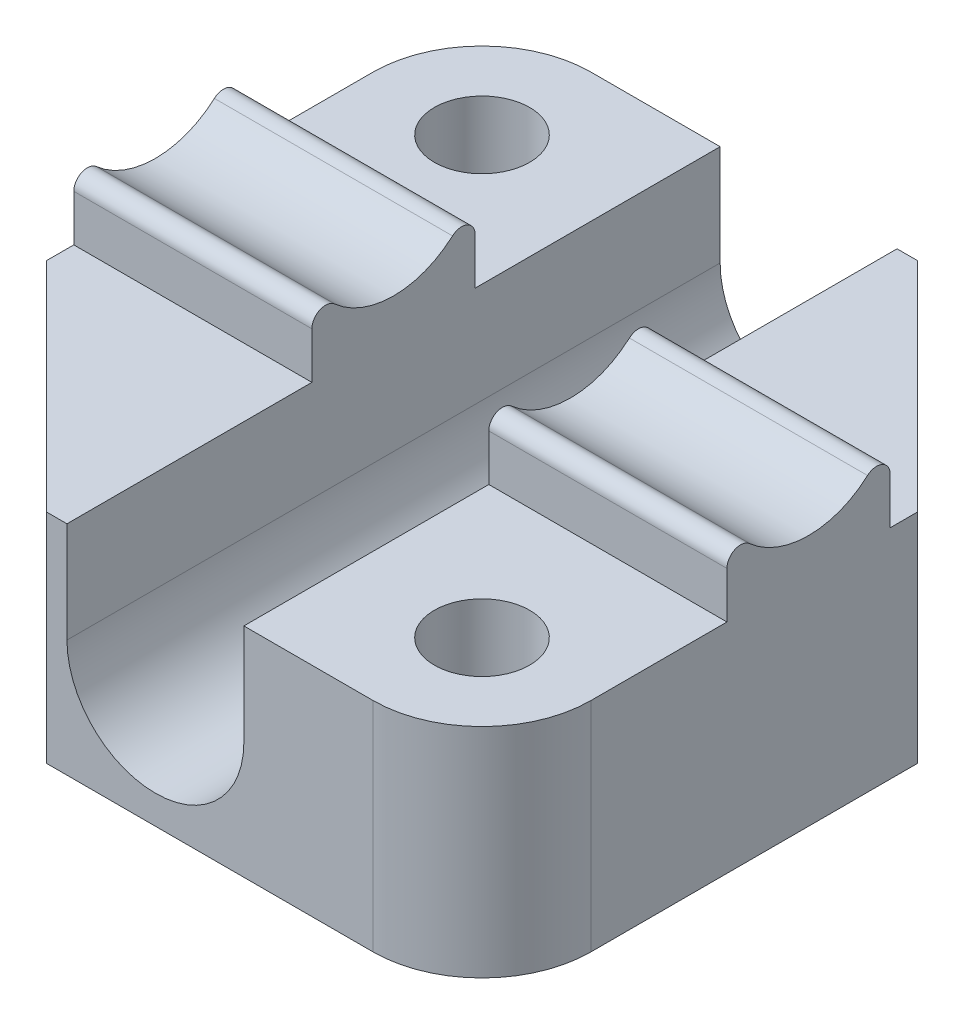
ISO-10303-21;
HEADER;
FILE_DESCRIPTION(('STEP AP214'),'2;1');
FILE_NAME('part.step','',(''),(''),'','','');
FILE_SCHEMA(('AUTOMOTIVE_DESIGN { 1 0 10303 214 1 1 1 1 }'));
ENDSEC;
DATA;
#1=APPLICATION_CONTEXT('core data for automotive mechanical design processes');
#2=APPLICATION_PROTOCOL_DEFINITION('international standard','automotive_design',2000,#1);
#3=PRODUCT_CONTEXT('',#1,'mechanical');
#4=PRODUCT('Part','Part','',(#3));
#5=PRODUCT_RELATED_PRODUCT_CATEGORY('part','',(#4));
#6=PRODUCT_DEFINITION_FORMATION('','',#4);
#7=PRODUCT_DEFINITION_CONTEXT('part definition',#1,'design');
#8=PRODUCT_DEFINITION('design','',#6,#7);
#9=PRODUCT_DEFINITION_SHAPE('','',#8);
#10=(LENGTH_UNIT() NAMED_UNIT(*) SI_UNIT(.MILLI.,.METRE.));
#11=(NAMED_UNIT(*) PLANE_ANGLE_UNIT() SI_UNIT($,.RADIAN.));
#12=(NAMED_UNIT(*) SI_UNIT($,.STERADIAN.) SOLID_ANGLE_UNIT());
#13=UNCERTAINTY_MEASURE_WITH_UNIT(LENGTH_MEASURE(1.E-05),#10,'distance_accuracy_value','');
#14=(GEOMETRIC_REPRESENTATION_CONTEXT(3) GLOBAL_UNCERTAINTY_ASSIGNED_CONTEXT((#13)) GLOBAL_UNIT_ASSIGNED_CONTEXT((#10,
#11,#12)) REPRESENTATION_CONTEXT('',''));
#15=CARTESIAN_POINT('',(0.,0.,0.));
#16=DIRECTION('',(0.,0.,1.));
#17=DIRECTION('',(1.,0.,0.));
#18=AXIS2_PLACEMENT_3D('',#15,#16,#17);
#19=CARTESIAN_POINT('',(0.,8.,0.));
#20=DIRECTION('',(0.,-1.,0.));
#21=DIRECTION('',(0.,0.,-1.));
#22=AXIS2_PLACEMENT_3D('',#19,#20,#21);
#23=PLANE('',#22);
#24=CARTESIAN_POINT('',(-8.,8.,-8.));
#25=DIRECTION('',(0.,1.,0.));
#26=DIRECTION('',(0.,0.,1.));
#27=AXIS2_PLACEMENT_3D('',#24,#25,#26);
#28=CIRCLE('',#27,1.75);
#29=CARTESIAN_POINT('',(-8.,8.,-6.25));
#30=VERTEX_POINT('',#29);
#31=EDGE_CURVE('E507',#30,#30,#28,.T.);
#32=ORIENTED_EDGE('',*,*,#31,.F.);
#33=EDGE_LOOP('',(#32));
#34=FACE_BOUND('',#33,.T.);
#35=DIRECTION('',(-1.,0.,0.));
#36=VECTOR('',#35,1.);
#37=CARTESIAN_POINT('',(-12.,8.,-12.));
#38=LINE('',#37,#36);
#39=CARTESIAN_POINT('',(-3.25,8.,-12.));
#40=VERTEX_POINT('',#39);
#41=CARTESIAN_POINT('',(-8.,8.,-12.));
#42=VERTEX_POINT('',#41);
#43=EDGE_CURVE('E241',#40,#42,#38,.T.);
#44=ORIENTED_EDGE('',*,*,#43,.T.);
#45=CARTESIAN_POINT('',(-8.,8.,-8.));
#46=DIRECTION('',(0.,-1.,0.));
#47=DIRECTION('',(0.,0.,-1.));
#48=AXIS2_PLACEMENT_3D('',#45,#46,#47);
#49=CIRCLE('',#48,4.);
#50=CARTESIAN_POINT('',(-12.,8.,-8.));
#51=VERTEX_POINT('',#50);
#52=EDGE_CURVE('E298',#42,#51,#49,.F.);
#53=ORIENTED_EDGE('',*,*,#52,.T.);
#54=DIRECTION('',(0.,0.,1.));
#55=VECTOR('',#54,1.);
#56=CARTESIAN_POINT('',(-12.,8.,12.));
#57=LINE('',#56,#55);
#58=CARTESIAN_POINT('',(-12.,8.,-3.));
#59=VERTEX_POINT('',#58);
#60=EDGE_CURVE('E211',#51,#59,#57,.T.);
#61=ORIENTED_EDGE('',*,*,#60,.T.);
#62=DIRECTION('',(-1.,0.,0.));
#63=VECTOR('',#62,1.);
#64=CARTESIAN_POINT('',(-3.25,8.,-3.));
#65=LINE('',#64,#63);
#66=CARTESIAN_POINT('',(-3.25,8.,-3.));
#67=VERTEX_POINT('',#66);
#68=EDGE_CURVE('E199',#67,#59,#65,.T.);
#69=ORIENTED_EDGE('',*,*,#68,.F.);
#70=DIRECTION('',(0.,0.,1.));
#71=VECTOR('',#70,1.);
#72=CARTESIAN_POINT('',(-3.25,8.,-12.));
#73=LINE('',#72,#71);
#74=EDGE_CURVE('E208',#40,#67,#73,.T.);
#75=ORIENTED_EDGE('',*,*,#74,.F.);
#76=EDGE_LOOP('',(#44,#53,#61,#69,#75));
#77=FACE_BOUND('',#76,.T.);
#78=ADVANCED_FACE('F35',(#34,#77),#23,.F.);
#79=CARTESIAN_POINT('',(8.,8.,8.));
#80=DIRECTION('',(0.,1.,0.));
#81=DIRECTION('',(0.,0.,-1.));
#82=AXIS2_PLACEMENT_3D('',#79,#80,#81);
#83=CIRCLE('',#82,1.75);
#84=CARTESIAN_POINT('',(8.,8.,6.25));
#85=VERTEX_POINT('',#84);
#86=EDGE_CURVE('E343',#85,#85,#83,.T.);
#87=ORIENTED_EDGE('',*,*,#86,.F.);
#88=EDGE_LOOP('',(#87));
#89=FACE_BOUND('',#88,.T.);
#90=DIRECTION('',(1.,0.,0.));
#91=VECTOR('',#90,1.);
#92=CARTESIAN_POINT('',(-12.,8.,12.));
#93=LINE('',#92,#91);
#94=CARTESIAN_POINT('',(3.25,8.,12.));
#95=VERTEX_POINT('',#94);
#96=CARTESIAN_POINT('',(8.,8.,12.));
#97=VERTEX_POINT('',#96);
#98=EDGE_CURVE('E247',#95,#97,#93,.T.);
#99=ORIENTED_EDGE('',*,*,#98,.T.);
#100=CARTESIAN_POINT('',(8.,8.,8.));
#101=DIRECTION('',(0.,-1.,0.));
#102=DIRECTION('',(0.,0.,-1.));
#103=AXIS2_PLACEMENT_3D('',#100,#101,#102);
#104=CIRCLE('',#103,4.);
#105=CARTESIAN_POINT('',(12.,8.,8.));
#106=VERTEX_POINT('',#105);
#107=EDGE_CURVE('E291',#97,#106,#104,.F.);
#108=ORIENTED_EDGE('',*,*,#107,.T.);
#109=DIRECTION('',(0.,0.,-1.));
#110=VECTOR('',#109,1.);
#111=CARTESIAN_POINT('',(12.,8.,12.));
#112=LINE('',#111,#110);
#113=CARTESIAN_POINT('',(12.,8.,3.));
#114=VERTEX_POINT('',#113);
#115=EDGE_CURVE('E239',#106,#114,#112,.T.);
#116=ORIENTED_EDGE('',*,*,#115,.T.);
#117=DIRECTION('',(1.,0.,0.));
#118=VECTOR('',#117,1.);
#119=CARTESIAN_POINT('',(3.25,8.,3.));
#120=LINE('',#119,#118);
#121=CARTESIAN_POINT('',(3.25,8.,3.));
#122=VERTEX_POINT('',#121);
#123=EDGE_CURVE('E462',#122,#114,#120,.T.);
#124=ORIENTED_EDGE('',*,*,#123,.F.);
#125=DIRECTION('',(0.,0.,1.));
#126=VECTOR('',#125,1.);
#127=CARTESIAN_POINT('',(3.25,8.,-12.));
#128=LINE('',#127,#126);
#129=EDGE_CURVE('E231',#122,#95,#128,.T.);
#130=ORIENTED_EDGE('',*,*,#129,.T.);
#131=EDGE_LOOP('',(#99,#108,#116,#124,#130));
#132=FACE_BOUND('',#131,.T.);
#133=ADVANCED_FACE('F395',(#89,#132),#23,.F.);
#134=CARTESIAN_POINT('',(-12.,8.,-12.));
#135=DIRECTION('',(0.,0.,1.));
#136=DIRECTION('',(1.,0.,0.));
#137=AXIS2_PLACEMENT_3D('',#134,#135,#136);
#138=PLANE('',#137);
#139=DIRECTION('',(-1.,0.,0.));
#140=VECTOR('',#139,1.);
#141=CARTESIAN_POINT('',(-12.,0.,-12.));
#142=LINE('',#141,#140);
#143=CARTESIAN_POINT('',(4.00000000000001,0.,-12.));
#144=VERTEX_POINT('',#143);
#145=CARTESIAN_POINT('',(-8.,0.,-12.));
#146=VERTEX_POINT('',#145);
#147=EDGE_CURVE('E252',#144,#146,#142,.T.);
#148=ORIENTED_EDGE('',*,*,#147,.T.);
#149=DIRECTION('',(0.,-1.,0.));
#150=VECTOR('',#149,1.);
#151=CARTESIAN_POINT('',(-8.,8.,-12.));
#152=LINE('',#151,#150);
#153=EDGE_CURVE('E296',#146,#42,#152,.F.);
#154=ORIENTED_EDGE('',*,*,#153,.T.);
#155=ORIENTED_EDGE('',*,*,#43,.F.);
#156=DIRECTION('',(0.,1.,0.));
#157=VECTOR('',#156,1.);
#158=CARTESIAN_POINT('',(-3.25,0.,-12.));
#159=LINE('',#158,#157);
#160=CARTESIAN_POINT('',(-3.25,4.3,-12.));
#161=VERTEX_POINT('',#160);
#162=EDGE_CURVE('E217',#161,#40,#159,.T.);
#163=ORIENTED_EDGE('',*,*,#162,.F.);
#164=CARTESIAN_POINT('',(0.,4.3,-12.));
#165=DIRECTION('',(0.,0.,1.));
#166=DIRECTION('',(1.,0.,0.));
#167=AXIS2_PLACEMENT_3D('',#164,#165,#166);
#168=CIRCLE('',#167,3.25);
#169=CARTESIAN_POINT('',(3.25,4.3,-12.));
#170=VERTEX_POINT('',#169);
#171=EDGE_CURVE('E469',#161,#170,#168,.T.);
#172=ORIENTED_EDGE('',*,*,#171,.T.);
#173=DIRECTION('',(0.,1.,0.));
#174=VECTOR('',#173,1.);
#175=CARTESIAN_POINT('',(3.25,0.,-12.));
#176=LINE('',#175,#174);
#177=CARTESIAN_POINT('',(3.25,8.,-12.));
#178=VERTEX_POINT('',#177);
#179=EDGE_CURVE('E228',#170,#178,#176,.T.);
#180=ORIENTED_EDGE('',*,*,#179,.T.);
#181=CARTESIAN_POINT('',(4.00000000000001,8.,-12.));
#182=VERTEX_POINT('',#181);
#183=EDGE_CURVE('E243',#182,#178,#38,.T.);
#184=ORIENTED_EDGE('',*,*,#183,.F.);
#185=DIRECTION('',(0.,-1.,0.));
#186=VECTOR('',#185,1.);
#187=CARTESIAN_POINT('',(4.00000000000001,8.,-12.));
#188=LINE('',#187,#186);
#189=EDGE_CURVE('E262',#182,#144,#188,.T.);
#190=ORIENTED_EDGE('',*,*,#189,.T.);
#191=EDGE_LOOP('',(#148,#154,#155,#163,#172,#180,#184,#190));
#192=FACE_BOUND('',#191,.T.);
#193=ADVANCED_FACE('F402',(#192),#138,.F.);
#194=CARTESIAN_POINT('',(-12.,8.,12.));
#195=DIRECTION('',(0.,0.,-1.));
#196=DIRECTION('',(-1.,0.,0.));
#197=AXIS2_PLACEMENT_3D('',#194,#195,#196);
#198=PLANE('',#197);
#199=DIRECTION('',(1.,0.,0.));
#200=VECTOR('',#199,1.);
#201=CARTESIAN_POINT('',(-12.,0.,12.));
#202=LINE('',#201,#200);
#203=CARTESIAN_POINT('',(-4.00000000000001,0.,12.));
#204=VERTEX_POINT('',#203);
#205=CARTESIAN_POINT('',(8.,0.,12.));
#206=VERTEX_POINT('',#205);
#207=EDGE_CURVE('E257',#204,#206,#202,.T.);
#208=ORIENTED_EDGE('',*,*,#207,.T.);
#209=DIRECTION('',(0.,-1.,0.));
#210=VECTOR('',#209,1.);
#211=CARTESIAN_POINT('',(8.,8.,12.));
#212=LINE('',#211,#210);
#213=EDGE_CURVE('E289',#206,#97,#212,.F.);
#214=ORIENTED_EDGE('',*,*,#213,.T.);
#215=ORIENTED_EDGE('',*,*,#98,.F.);
#216=DIRECTION('',(0.,-1.,0.));
#217=VECTOR('',#216,1.);
#218=CARTESIAN_POINT('',(3.25,8.,12.));
#219=LINE('',#218,#217);
#220=CARTESIAN_POINT('',(3.25,4.3,12.));
#221=VERTEX_POINT('',#220);
#222=EDGE_CURVE('E218',#95,#221,#219,.T.);
#223=ORIENTED_EDGE('',*,*,#222,.T.);
#224=CARTESIAN_POINT('',(0.,4.3,12.));
#225=DIRECTION('',(0.,0.,1.));
#226=DIRECTION('',(1.,0.,0.));
#227=AXIS2_PLACEMENT_3D('',#224,#225,#226);
#228=CIRCLE('',#227,3.25);
#229=CARTESIAN_POINT('',(-3.25,4.3,12.));
#230=VERTEX_POINT('',#229);
#231=EDGE_CURVE('E250',#221,#230,#228,.F.);
#232=ORIENTED_EDGE('',*,*,#231,.T.);
#233=DIRECTION('',(0.,-1.,0.));
#234=VECTOR('',#233,1.);
#235=CARTESIAN_POINT('',(-3.25,8.,12.));
#236=LINE('',#235,#234);
#237=CARTESIAN_POINT('',(-3.25,8.,12.));
#238=VERTEX_POINT('',#237);
#239=EDGE_CURVE('E222',#238,#230,#236,.T.);
#240=ORIENTED_EDGE('',*,*,#239,.F.);
#241=CARTESIAN_POINT('',(-4.00000000000001,8.,12.));
#242=VERTEX_POINT('',#241);
#243=EDGE_CURVE('E248',#242,#238,#93,.T.);
#244=ORIENTED_EDGE('',*,*,#243,.F.);
#245=DIRECTION('',(0.,-1.,0.));
#246=VECTOR('',#245,1.);
#247=CARTESIAN_POINT('',(-4.00000000000001,8.,12.));
#248=LINE('',#247,#246);
#249=EDGE_CURVE('E275',#242,#204,#248,.T.);
#250=ORIENTED_EDGE('',*,*,#249,.T.);
#251=EDGE_LOOP('',(#208,#214,#215,#223,#232,#240,#244,#250));
#252=FACE_BOUND('',#251,.T.);
#253=ADVANCED_FACE('F421',(#252),#198,.F.);
#254=CARTESIAN_POINT('',(-12.,8.,3.));
#255=VERTEX_POINT('',#254);
#256=CARTESIAN_POINT('',(-12.,8.,3.99999999999998));
#257=VERTEX_POINT('',#256);
#258=EDGE_CURVE('E245',#255,#257,#57,.T.);
#259=ORIENTED_EDGE('',*,*,#258,.T.);
#260=DIRECTION('',(-0.707106781186546,0.,-0.707106781186549));
#261=VECTOR('',#260,1.);
#262=CARTESIAN_POINT('',(-4.00000000000001,8.,12.));
#263=LINE('',#262,#261);
#264=EDGE_CURVE('E280',#257,#242,#263,.F.);
#265=ORIENTED_EDGE('',*,*,#264,.T.);
#266=ORIENTED_EDGE('',*,*,#243,.T.);
#267=CARTESIAN_POINT('',(-3.25,8.,3.));
#268=VERTEX_POINT('',#267);
#269=EDGE_CURVE('E219',#268,#238,#73,.T.);
#270=ORIENTED_EDGE('',*,*,#269,.F.);
#271=DIRECTION('',(-1.,0.,0.));
#272=VECTOR('',#271,1.);
#273=CARTESIAN_POINT('',(-3.25,8.,3.));
#274=LINE('',#273,#272);
#275=EDGE_CURVE('E202',#268,#255,#274,.T.);
#276=ORIENTED_EDGE('',*,*,#275,.T.);
#277=EDGE_LOOP('',(#259,#265,#266,#270,#276));
#278=FACE_BOUND('',#277,.T.);
#279=ADVANCED_FACE('F404',(#278),#23,.F.);
#280=CARTESIAN_POINT('',(12.,8.,12.));
#281=DIRECTION('',(-1.,0.,0.));
#282=DIRECTION('',(0.,0.,1.));
#283=AXIS2_PLACEMENT_3D('',#280,#281,#282);
#284=PLANE('',#283);
#285=DIRECTION('',(0.,1.,0.));
#286=VECTOR('',#285,1.);
#287=CARTESIAN_POINT('',(12.,8.,-3.));
#288=LINE('',#287,#286);
#289=CARTESIAN_POINT('',(12.,8.,-3.));
#290=VERTEX_POINT('',#289);
#291=CARTESIAN_POINT('',(12.,9.70491502812526,-3.));
#292=VERTEX_POINT('',#291);
#293=EDGE_CURVE('E213',#290,#292,#288,.T.);
#294=ORIENTED_EDGE('',*,*,#293,.T.);
#295=CARTESIAN_POINT('',(12.,9.70491502812526,-2.5));
#296=DIRECTION('',(-1.,0.,0.));
#297=DIRECTION('',(0.,0.,1.));
#298=AXIS2_PLACEMENT_3D('',#295,#296,#297);
#299=CIRCLE('',#298,0.5);
#300=CARTESIAN_POINT('',(12.,10.0775930243752,-2.16666666666667));
#301=VERTEX_POINT('',#300);
#302=EDGE_CURVE('E305',#292,#301,#299,.F.);
#303=ORIENTED_EDGE('',*,*,#302,.T.);
#304=CARTESIAN_POINT('',(12.,12.5,0.));
#305=DIRECTION('',(1.,0.,0.));
#306=DIRECTION('',(0.,0.,-1.));
#307=AXIS2_PLACEMENT_3D('',#304,#305,#306);
#308=CIRCLE('',#307,3.25);
#309=CARTESIAN_POINT('',(12.,10.0775930243752,2.16666666666667));
#310=VERTEX_POINT('',#309);
#311=EDGE_CURVE('E491',#310,#301,#308,.T.);
#312=ORIENTED_EDGE('',*,*,#311,.F.);
#313=CARTESIAN_POINT('',(12.,9.70491502812526,2.5));
#314=DIRECTION('',(-1.,0.,0.));
#315=DIRECTION('',(0.,0.,1.));
#316=AXIS2_PLACEMENT_3D('',#313,#314,#315);
#317=CIRCLE('',#316,0.5);
#318=CARTESIAN_POINT('',(12.,9.70491502812526,3.));
#319=VERTEX_POINT('',#318);
#320=EDGE_CURVE('E303',#310,#319,#317,.F.);
#321=ORIENTED_EDGE('',*,*,#320,.T.);
#322=DIRECTION('',(0.,1.,0.));
#323=VECTOR('',#322,1.);
#324=CARTESIAN_POINT('',(12.,8.,3.));
#325=LINE('',#324,#323);
#326=EDGE_CURVE('E457',#114,#319,#325,.T.);
#327=ORIENTED_EDGE('',*,*,#326,.F.);
#328=ORIENTED_EDGE('',*,*,#115,.F.);
#329=DIRECTION('',(0.,-1.,0.));
#330=VECTOR('',#329,1.);
#331=CARTESIAN_POINT('',(12.,8.,8.));
#332=LINE('',#331,#330);
#333=CARTESIAN_POINT('',(12.,0.,8.));
#334=VERTEX_POINT('',#333);
#335=EDGE_CURVE('E282',#106,#334,#332,.T.);
#336=ORIENTED_EDGE('',*,*,#335,.T.);
#337=DIRECTION('',(0.,0.,-1.));
#338=VECTOR('',#337,1.);
#339=CARTESIAN_POINT('',(12.,0.,12.));
#340=LINE('',#339,#338);
#341=CARTESIAN_POINT('',(12.,0.,-3.99999999999998));
#342=VERTEX_POINT('',#341);
#343=EDGE_CURVE('E238',#334,#342,#340,.T.);
#344=ORIENTED_EDGE('',*,*,#343,.T.);
#345=DIRECTION('',(0.,1.,0.));
#346=VECTOR('',#345,1.);
#347=CARTESIAN_POINT('',(12.,8.,-3.99999999999998));
#348=LINE('',#347,#346);
#349=CARTESIAN_POINT('',(12.,8.,-3.99999999999998));
#350=VERTEX_POINT('',#349);
#351=EDGE_CURVE('E271',#342,#350,#348,.T.);
#352=ORIENTED_EDGE('',*,*,#351,.T.);
#353=EDGE_CURVE('E242',#290,#350,#112,.T.);
#354=ORIENTED_EDGE('',*,*,#353,.F.);
#355=EDGE_LOOP('',(#294,#303,#312,#321,#327,#328,#336,#344,#352,#354));
#356=FACE_BOUND('',#355,.T.);
#357=ADVANCED_FACE('F416',(#356),#284,.F.);
#358=CARTESIAN_POINT('',(-12.,8.,12.));
#359=DIRECTION('',(1.,0.,0.));
#360=DIRECTION('',(0.,0.,-1.));
#361=AXIS2_PLACEMENT_3D('',#358,#359,#360);
#362=PLANE('',#361);
#363=CARTESIAN_POINT('',(-12.,12.5,0.));
#364=DIRECTION('',(1.,0.,0.));
#365=DIRECTION('',(0.,0.,-1.));
#366=AXIS2_PLACEMENT_3D('',#363,#364,#365);
#367=CIRCLE('',#366,3.25);
#368=CARTESIAN_POINT('',(-12.,10.0775930243752,2.16666666666667));
#369=VERTEX_POINT('',#368);
#370=CARTESIAN_POINT('',(-12.,10.0775930243752,-2.16666666666667));
#371=VERTEX_POINT('',#370);
#372=EDGE_CURVE('E503',#369,#371,#367,.T.);
#373=ORIENTED_EDGE('',*,*,#372,.T.);
#374=CARTESIAN_POINT('',(-12.,9.70491502812526,-2.5));
#375=DIRECTION('',(1.,0.,0.));
#376=DIRECTION('',(0.,0.,-1.));
#377=AXIS2_PLACEMENT_3D('',#374,#375,#376);
#378=CIRCLE('',#377,0.5);
#379=CARTESIAN_POINT('',(-12.,9.70491502812526,-3.));
#380=VERTEX_POINT('',#379);
#381=EDGE_CURVE('E323',#371,#380,#378,.F.);
#382=ORIENTED_EDGE('',*,*,#381,.T.);
#383=DIRECTION('',(0.,1.,0.));
#384=VECTOR('',#383,1.);
#385=CARTESIAN_POINT('',(-12.,8.,-3.));
#386=LINE('',#385,#384);
#387=EDGE_CURVE('E500',#59,#380,#386,.T.);
#388=ORIENTED_EDGE('',*,*,#387,.F.);
#389=ORIENTED_EDGE('',*,*,#60,.F.);
#390=DIRECTION('',(0.,-1.,0.));
#391=VECTOR('',#390,1.);
#392=CARTESIAN_POINT('',(-12.,8.,-8.));
#393=LINE('',#392,#391);
#394=CARTESIAN_POINT('',(-12.,0.,-8.));
#395=VERTEX_POINT('',#394);
#396=EDGE_CURVE('E293',#51,#395,#393,.T.);
#397=ORIENTED_EDGE('',*,*,#396,.T.);
#398=DIRECTION('',(0.,0.,1.));
#399=VECTOR('',#398,1.);
#400=CARTESIAN_POINT('',(-12.,0.,12.));
#401=LINE('',#400,#399);
#402=CARTESIAN_POINT('',(-12.,0.,3.99999999999998));
#403=VERTEX_POINT('',#402);
#404=EDGE_CURVE('E255',#395,#403,#401,.T.);
#405=ORIENTED_EDGE('',*,*,#404,.T.);
#406=DIRECTION('',(0.,1.,0.));
#407=VECTOR('',#406,1.);
#408=CARTESIAN_POINT('',(-12.,8.,3.99999999999998));
#409=LINE('',#408,#407);
#410=EDGE_CURVE('E278',#403,#257,#409,.T.);
#411=ORIENTED_EDGE('',*,*,#410,.T.);
#412=ORIENTED_EDGE('',*,*,#258,.F.);
#413=DIRECTION('',(0.,1.,0.));
#414=VECTOR('',#413,1.);
#415=CARTESIAN_POINT('',(-12.,8.,3.));
#416=LINE('',#415,#414);
#417=CARTESIAN_POINT('',(-12.,9.70491502812526,3.));
#418=VERTEX_POINT('',#417);
#419=EDGE_CURVE('E506',#255,#418,#416,.T.);
#420=ORIENTED_EDGE('',*,*,#419,.T.);
#421=CARTESIAN_POINT('',(-12.,9.70491502812526,2.5));
#422=DIRECTION('',(1.,0.,0.));
#423=DIRECTION('',(0.,0.,-1.));
#424=AXIS2_PLACEMENT_3D('',#421,#422,#423);
#425=CIRCLE('',#424,0.5);
#426=EDGE_CURVE('E321',#418,#369,#425,.F.);
#427=ORIENTED_EDGE('',*,*,#426,.T.);
#428=EDGE_LOOP('',(#373,#382,#388,#389,#397,#405,#411,#412,#420,#427));
#429=FACE_BOUND('',#428,.T.);
#430=ADVANCED_FACE('F409',(#429),#362,.F.);
#431=ORIENTED_EDGE('',*,*,#353,.T.);
#432=DIRECTION('',(0.707106781186546,0.,0.707106781186549));
#433=VECTOR('',#432,1.);
#434=CARTESIAN_POINT('',(4.00000000000001,8.,-12.));
#435=LINE('',#434,#433);
#436=EDGE_CURVE('E273',#350,#182,#435,.F.);
#437=ORIENTED_EDGE('',*,*,#436,.T.);
#438=ORIENTED_EDGE('',*,*,#183,.T.);
#439=CARTESIAN_POINT('',(3.25,8.,-3.));
#440=VERTEX_POINT('',#439);
#441=EDGE_CURVE('E225',#178,#440,#128,.T.);
#442=ORIENTED_EDGE('',*,*,#441,.T.);
#443=DIRECTION('',(1.,0.,0.));
#444=VECTOR('',#443,1.);
#445=CARTESIAN_POINT('',(3.25,8.,-3.));
#446=LINE('',#445,#444);
#447=EDGE_CURVE('E467',#440,#290,#446,.T.);
#448=ORIENTED_EDGE('',*,*,#447,.T.);
#449=EDGE_LOOP('',(#431,#437,#438,#442,#448));
#450=FACE_BOUND('',#449,.T.);
#451=ADVANCED_FACE('F398',(#450),#23,.F.);
#452=CARTESIAN_POINT('',(0.,0.,0.));
#453=DIRECTION('',(0.,-1.,0.));
#454=DIRECTION('',(0.,0.,-1.));
#455=AXIS2_PLACEMENT_3D('',#452,#453,#454);
#456=PLANE('',#455);
#457=CARTESIAN_POINT('',(8.,0.,8.));
#458=DIRECTION('',(0.,-1.,0.));
#459=DIRECTION('',(0.,0.,-1.));
#460=AXIS2_PLACEMENT_3D('',#457,#458,#459);
#461=CIRCLE('',#460,2.25000000000001);
#462=CARTESIAN_POINT('',(8.,0.,5.74999999999999));
#463=VERTEX_POINT('',#462);
#464=EDGE_CURVE('E564',#463,#463,#461,.F.);
#465=ORIENTED_EDGE('',*,*,#464,.T.);
#466=EDGE_LOOP('',(#465));
#467=FACE_BOUND('',#466,.T.);
#468=CARTESIAN_POINT('',(-8.,0.,-8.));
#469=DIRECTION('',(0.,-1.,0.));
#470=DIRECTION('',(0.,0.,-1.));
#471=AXIS2_PLACEMENT_3D('',#468,#469,#470);
#472=CIRCLE('',#471,2.25000000000001);
#473=CARTESIAN_POINT('',(-8.,0.,-10.25));
#474=VERTEX_POINT('',#473);
#475=EDGE_CURVE('E334',#474,#474,#472,.F.);
#476=ORIENTED_EDGE('',*,*,#475,.T.);
#477=EDGE_LOOP('',(#476));
#478=FACE_BOUND('',#477,.T.);
#479=CARTESIAN_POINT('',(0.,0.,0.));
#480=DIRECTION('',(0.,-1.,0.));
#481=DIRECTION('',(0.,0.,-1.));
#482=AXIS2_PLACEMENT_3D('',#479,#480,#481);
#483=CIRCLE('',#482,2.);
#484=CARTESIAN_POINT('',(0.,0.,-2.));
#485=VERTEX_POINT('',#484);
#486=EDGE_CURVE('E344',#485,#485,#483,.T.);
#487=ORIENTED_EDGE('',*,*,#486,.F.);
#488=EDGE_LOOP('',(#487));
#489=FACE_BOUND('',#488,.T.);
#490=ORIENTED_EDGE('',*,*,#343,.F.);
#491=CARTESIAN_POINT('',(8.,0.,8.));
#492=DIRECTION('',(0.,-1.,0.));
#493=DIRECTION('',(0.,0.,-1.));
#494=AXIS2_PLACEMENT_3D('',#491,#492,#493);
#495=CIRCLE('',#494,4.);
#496=EDGE_CURVE('E287',#334,#206,#495,.T.);
#497=ORIENTED_EDGE('',*,*,#496,.T.);
#498=ORIENTED_EDGE('',*,*,#207,.F.);
#499=DIRECTION('',(0.707106781186546,0.,0.707106781186549));
#500=VECTOR('',#499,1.);
#501=CARTESIAN_POINT('',(-8.00000000000001,0.,7.99999999999998));
#502=LINE('',#501,#500);
#503=EDGE_CURVE('E265',#204,#403,#502,.F.);
#504=ORIENTED_EDGE('',*,*,#503,.T.);
#505=ORIENTED_EDGE('',*,*,#404,.F.);
#506=CARTESIAN_POINT('',(-8.,0.,-8.));
#507=DIRECTION('',(0.,-1.,0.));
#508=DIRECTION('',(0.,0.,-1.));
#509=AXIS2_PLACEMENT_3D('',#506,#507,#508);
#510=CIRCLE('',#509,4.);
#511=EDGE_CURVE('E285',#395,#146,#510,.T.);
#512=ORIENTED_EDGE('',*,*,#511,.T.);
#513=ORIENTED_EDGE('',*,*,#147,.F.);
#514=DIRECTION('',(-0.707106781186546,0.,-0.707106781186549));
#515=VECTOR('',#514,1.);
#516=CARTESIAN_POINT('',(8.00000000000001,0.,-7.99999999999998));
#517=LINE('',#516,#515);
#518=EDGE_CURVE('E268',#144,#342,#517,.F.);
#519=ORIENTED_EDGE('',*,*,#518,.T.);
#520=EDGE_LOOP('',(#490,#497,#498,#504,#505,#512,#513,#519));
#521=FACE_BOUND('',#520,.T.);
#522=ADVANCED_FACE('F408',(#467,#478,#489,#521),#456,.T.);
#523=CARTESIAN_POINT('',(0.,4.3,-12.));
#524=DIRECTION('',(0.,0.,1.));
#525=DIRECTION('',(1.,0.,0.));
#526=AXIS2_PLACEMENT_3D('',#523,#524,#525);
#527=CYLINDRICAL_SURFACE('',#526,3.25);
#528=CARTESIAN_POINT('',(0.,1.05,-2.));
#529=CARTESIAN_POINT('',(0.10188132615055,1.05000709042641,-1.99999223881238));
#530=CARTESIAN_POINT('',(0.203904103349815,1.05484207993841,-1.99216106424513));
#531=CARTESIAN_POINT('',(0.404842186070283,1.07372622710523,-1.96124608973787));
#532=CARTESIAN_POINT('',(0.503750411471347,1.08779498468937,-1.93812984437488));
#533=CARTESIAN_POINT('',(0.69514473213188,1.12372705529894,-1.87797427817155));
#534=CARTESIAN_POINT('',(0.787660008863522,1.14555170941448,-1.84100396338244));
#535=CARTESIAN_POINT('',(0.964865128941514,1.19516273730987,-1.75464001753296));
#536=CARTESIAN_POINT('',(1.04955624068904,1.22294814233793,-1.70524840497948));
#537=CARTESIAN_POINT('',(1.21623879138585,1.28474377980787,-1.59114837284488));
#538=CARTESIAN_POINT('',(1.2974950249712,1.31907160252721,-1.52554128938594));
#539=CARTESIAN_POINT('',(1.44856625896382,1.38948142143222,-1.38292006727544));
#540=CARTESIAN_POINT('',(1.51836589377143,1.42556569066295,-1.30589086845065));
#541=CARTESIAN_POINT('',(1.6537974950807,1.50103440147234,-1.13082108971031));
#542=CARTESIAN_POINT('',(1.71769808834148,1.54023532279291,-1.0313504004329));
#543=CARTESIAN_POINT('',(1.82766613597321,1.6117932701056,-0.820781529591239));
#544=CARTESIAN_POINT('',(1.87376330939879,1.64416166024131,-0.709703122045502));
#545=CARTESIAN_POINT('',(1.93663007531596,1.68981298800098,-0.507603992249496));
#546=CARTESIAN_POINT('',(1.95786551874072,1.70585114290655,-0.418598382650922));
#547=CARTESIAN_POINT('',(1.98797289662736,1.72884546195975,-0.237419347642413));
#548=CARTESIAN_POINT('',(1.99686146422318,1.73581384368248,-0.145250355762082));
#549=CARTESIAN_POINT('',(2.00175000655706,1.73962702201248,0.0398636884012098));
#550=CARTESIAN_POINT('',(1.99771967393425,1.73644801321249,0.13281005462901));
#551=CARTESIAN_POINT('',(1.97697133638861,1.72041759661331,0.316446433338687));
#552=CARTESIAN_POINT('',(1.96024338773127,1.70755860831114,0.407134619884074));
#553=CARTESIAN_POINT('',(1.91546110388895,1.67430805717643,0.582267812593107));
#554=CARTESIAN_POINT('',(1.88762552544911,1.65406259017612,0.666798115990082));
#555=CARTESIAN_POINT('',(1.82169352273914,1.60824575420991,0.830182914664653));
#556=CARTESIAN_POINT('',(1.78359342306537,1.58267247826749,0.909035364038927));
#557=CARTESIAN_POINT('',(1.69022183410356,1.52345000053112,1.07410837738161));
#558=CARTESIAN_POINT('',(1.63308612098802,1.48917846864654,1.15905115829329));
#559=CARTESIAN_POINT('',(1.50681538592695,1.41951073688712,1.31905669865881));
#560=CARTESIAN_POINT('',(1.43766832976988,1.38411343843887,1.39410941531334));
#561=CARTESIAN_POINT('',(1.2766674389618,1.30974227547488,1.54402409710659));
#562=CARTESIAN_POINT('',(1.182955630921,1.2710626325799,1.61705916240018));
#563=CARTESIAN_POINT('',(0.982297748331433,1.20017910581058,1.74622462373111));
#564=CARTESIAN_POINT('',(0.875357722797127,1.16797227959435,1.80236270641464));
#565=CARTESIAN_POINT('',(0.657333180235023,1.11531144103009,1.89235101894978));
#566=CARTESIAN_POINT('',(0.546848787692421,1.09428411033942,1.92730509359417));
#567=CARTESIAN_POINT('',(0.320015702193349,1.06377937076516,1.97763358395682));
#568=CARTESIAN_POINT('',(0.203675020090538,1.05428660800891,1.99303402909634));
#569=CARTESIAN_POINT('',(-0.0133751121969597,1.04847888539736,2.00247098840239));
#570=CARTESIAN_POINT('',(-0.113930519426018,1.05046755966392,1.99925743978143));
#571=CARTESIAN_POINT('',(-0.312828128438587,1.06355702735641,1.97791203828788));
#572=CARTESIAN_POINT('',(-0.411170435426588,1.07465738669467,1.95978089610082));
#573=CARTESIAN_POINT('',(-0.599675310389413,1.1044236757768,1.91038715524057));
#574=CARTESIAN_POINT('',(-0.690000941068836,1.12282673371163,1.87957957275139));
#575=CARTESIAN_POINT('',(-0.864136822693357,1.16570308772745,1.8061572347355));
#576=CARTESIAN_POINT('',(-0.947945911471298,1.1901774633274,1.76354037928695));
#577=CARTESIAN_POINT('',(-1.11596559810314,1.24619182838784,1.66288062931433));
#578=CARTESIAN_POINT('',(-1.19933976552702,1.27819855010881,1.60370548122827));
#579=CARTESIAN_POINT('',(-1.35558080044099,1.34498114667612,1.47401785508296));
#580=CARTESIAN_POINT('',(-1.42843552095417,1.37976015195795,1.40349246622746));
#581=CARTESIAN_POINT('',(-1.57209410371064,1.45422469001532,1.24169624638608));
#582=CARTESIAN_POINT('',(-1.64118984864469,1.49391696319292,1.14890366751528));
#583=CARTESIAN_POINT('',(-1.76298838595567,1.56879394048457,0.951470248786335));
#584=CARTESIAN_POINT('',(-1.81570499765242,1.60398242968501,0.846839499217129));
#585=CARTESIAN_POINT('',(-1.89339358839071,1.6581613311761,0.650899733779575));
#586=CARTESIAN_POINT('',(-1.92188436296886,1.67900566963833,0.561505445797855));
#587=CARTESIAN_POINT('',(-1.96618336594087,1.71206648537687,0.378137789528581));
#588=CARTESIAN_POINT('',(-1.98201065217434,1.72429592426451,0.284171528762354));
#589=CARTESIAN_POINT('',(-2.00010464267678,1.7383158380037,0.0936616473844894));
#590=CARTESIAN_POINT('',(-2.0023046831458,1.74005499383558,-0.00289232645302492));
#591=CARTESIAN_POINT('',(-1.99280157568836,1.732652740724,-0.194910569759687));
#592=CARTESIAN_POINT('',(-1.98109240693129,1.72350661990577,-0.290374349255553));
#593=CARTESIAN_POINT('',(-1.94579545599171,1.69676782440383,-0.470934027473978));
#594=CARTESIAN_POINT('',(-1.92306270422408,1.67978687356565,-0.556294824863431));
#595=CARTESIAN_POINT('',(-1.86718802785544,1.63968290695689,-0.721985032960768));
#596=CARTESIAN_POINT('',(-1.83404200040863,1.61655747080508,-0.802312445519045));
#597=CARTESIAN_POINT('',(-1.75262914114964,1.56257232880558,-0.968550615604479));
#598=CARTESIAN_POINT('',(-1.70284443802986,1.53107350495229,-1.05350732582916));
#599=CARTESIAN_POINT('',(-1.59188565276047,1.46582435029827,-1.21469761439933));
#600=CARTESIAN_POINT('',(-1.5307021746581,1.4320721769074,-1.2909239119987));
#601=CARTESIAN_POINT('',(-1.38545758375244,1.35878017835806,-1.44701947136119));
#602=CARTESIAN_POINT('',(-1.29925816340265,1.31932346854052,-1.52495873982607));
#603=CARTESIAN_POINT('',(-1.11333551361917,1.24499995250216,-1.6655571681677));
#604=CARTESIAN_POINT('',(-1.01360542298858,1.21013549273399,-1.72820853037864));
#605=CARTESIAN_POINT('',(-0.803670051007969,1.14907024070662,-1.83514847799618));
#606=CARTESIAN_POINT('',(-0.693601004958838,1.12277284172499,-1.87964336256851));
#607=CARTESIAN_POINT('',(-0.522752351293609,1.09179142740241,-1.93139370400136));
#608=CARTESIAN_POINT('',(-0.464905172981802,1.08287970244721,-1.94613797433703));
#609=CARTESIAN_POINT('',(-0.347763300809827,1.06812270313969,-1.97043833255163));
#610=CARTESIAN_POINT('',(-0.288469766294379,1.06227505212897,-1.97999844174263));
#611=CARTESIAN_POINT('',(-0.190864646604475,1.05538641634488,-1.99123787128312));
#612=CARTESIAN_POINT('',(-0.152796856697307,1.05336998366956,-1.99452014809024));
#613=CARTESIAN_POINT('',(-0.0764926990504119,1.05067540594908,-1.99890273209226));
#614=CARTESIAN_POINT('',(-0.0382563217812482,1.04999733755297,-2.0000029143171));
#615=CARTESIAN_POINT('',(0.,1.05,-2.));
#616=B_SPLINE_CURVE_WITH_KNOTS('',3,(#528,#529,#530,#531,#532,#533,#534,#535,#536,#537,#538,
#539,#540,#541,#542,#543,#544,#545,#546,#547,#548,#549,#550,#551,#552,#553,#554,#555,#556,#557,
#558,#559,#560,#561,#562,#563,#564,#565,#566,#567,#568,#569,#570,#571,#572,#573,#574,#575,#576,
#577,#578,#579,#580,#581,#582,#583,#584,#585,#586,#587,#588,#589,#590,#591,#592,#593,#594,#595,
#596,#597,#598,#599,#600,#601,#602,#603,#604,#605,#606,#607,#608,#609,#610,#611,#612,#613,#614,
#615),.UNSPECIFIED.,.T.,.F.,(4,2,2,2,2,2,2,2,2,2,2,2,2,2,2,2,2,2,2,2,2,2,2,2,2,2,2,2,2,2,2,2,2,
2,2,2,2,2,2,2,2,2,2,4),(0.,0.305489244453989,0.611629037684759,0.916263813929084,
1.22084911784633,1.54937088487582,1.87832972747692,2.25019987503111,2.62144655274183,
2.89897677771232,3.17613276314803,3.45393942383982,3.73196386472733,4.00476357743727,
4.27766110130794,4.60031376584195,4.9232915817745,5.29625092391901,5.66904034492647,
6.02020803058853,6.37090775667979,6.67125427459488,6.97158648460146,7.26196721447629,
7.55239961294813,7.87255050124719,8.19306816619151,8.55835890346529,8.92334059725927,
9.21051973834812,9.49726587371139,9.78541365598754,10.0736862132484,10.3425030692614,
10.6114259726192,10.9204567058264,11.2297433076941,11.5961861459252,11.9628155011263,
12.325154619742,12.505967795967,12.6866405155051,12.8013448094052,12.9160556723093),.UNSPECIFIED.);
#617=CARTESIAN_POINT('',(0.,1.05,-2.));
#618=VERTEX_POINT('',#617);
#619=EDGE_CURVE('E335',#618,#618,#616,.T.);
#620=ORIENTED_EDGE('',*,*,#619,.T.);
#621=EDGE_LOOP('',(#620));
#622=FACE_BOUND('',#621,.T.);
#623=DIRECTION('',(0.,0.,1.));
#624=VECTOR('',#623,1.);
#625=CARTESIAN_POINT('',(3.25,4.3,-12.));
#626=LINE('',#625,#624);
#627=EDGE_CURVE('E235',#170,#221,#626,.T.);
#628=ORIENTED_EDGE('',*,*,#627,.F.);
#629=ORIENTED_EDGE('',*,*,#171,.F.);
#630=DIRECTION('',(0.,0.,1.));
#631=VECTOR('',#630,1.);
#632=CARTESIAN_POINT('',(-3.25,4.3,-12.));
#633=LINE('',#632,#631);
#634=EDGE_CURVE('E232',#161,#230,#633,.T.);
#635=ORIENTED_EDGE('',*,*,#634,.T.);
#636=ORIENTED_EDGE('',*,*,#231,.F.);
#637=EDGE_LOOP('',(#628,#629,#635,#636));
#638=FACE_BOUND('',#637,.T.);
#639=ADVANCED_FACE('F346',(#622,#638),#527,.F.);
#640=CARTESIAN_POINT('',(-3.25,0.,-12.));
#641=DIRECTION('',(1.,0.,0.));
#642=DIRECTION('',(0.,0.,-1.));
#643=AXIS2_PLACEMENT_3D('',#640,#641,#642);
#644=PLANE('',#643);
#645=DIRECTION('',(0.,1.,0.));
#646=VECTOR('',#645,1.);
#647=CARTESIAN_POINT('',(-3.25,8.,-3.));
#648=LINE('',#647,#646);
#649=CARTESIAN_POINT('',(-3.25,9.70491502812526,-3.));
#650=VERTEX_POINT('',#649);
#651=EDGE_CURVE('E196',#67,#650,#648,.T.);
#652=ORIENTED_EDGE('',*,*,#651,.T.);
#653=CARTESIAN_POINT('',(-3.25,9.70491502812526,-2.5));
#654=DIRECTION('',(1.,0.,0.));
#655=DIRECTION('',(0.,0.,-1.));
#656=AXIS2_PLACEMENT_3D('',#653,#654,#655);
#657=CIRCLE('',#656,0.5);
#658=CARTESIAN_POINT('',(-3.25,10.0775930243752,-2.16666666666667));
#659=VERTEX_POINT('',#658);
#660=EDGE_CURVE('E327',#650,#659,#657,.T.);
#661=ORIENTED_EDGE('',*,*,#660,.T.);
#662=CARTESIAN_POINT('',(-3.25,12.5,0.));
#663=DIRECTION('',(1.,0.,0.));
#664=DIRECTION('',(0.,0.,-1.));
#665=AXIS2_PLACEMENT_3D('',#662,#663,#664);
#666=CIRCLE('',#665,3.25);
#667=CARTESIAN_POINT('',(-3.25,10.0775930243752,2.16666666666667));
#668=VERTEX_POINT('',#667);
#669=EDGE_CURVE('E203',#668,#659,#666,.T.);
#670=ORIENTED_EDGE('',*,*,#669,.F.);
#671=CARTESIAN_POINT('',(-3.25,9.70491502812526,2.5));
#672=DIRECTION('',(1.,0.,0.));
#673=DIRECTION('',(0.,0.,-1.));
#674=AXIS2_PLACEMENT_3D('',#671,#672,#673);
#675=CIRCLE('',#674,0.5);
#676=CARTESIAN_POINT('',(-3.25,9.70491502812526,3.));
#677=VERTEX_POINT('',#676);
#678=EDGE_CURVE('E50',#668,#677,#675,.T.);
#679=ORIENTED_EDGE('',*,*,#678,.T.);
#680=DIRECTION('',(0.,1.,0.));
#681=VECTOR('',#680,1.);
#682=CARTESIAN_POINT('',(-3.25,8.,3.));
#683=LINE('',#682,#681);
#684=EDGE_CURVE('E502',#268,#677,#683,.T.);
#685=ORIENTED_EDGE('',*,*,#684,.F.);
#686=ORIENTED_EDGE('',*,*,#269,.T.);
#687=ORIENTED_EDGE('',*,*,#239,.T.);
#688=ORIENTED_EDGE('',*,*,#634,.F.);
#689=ORIENTED_EDGE('',*,*,#162,.T.);
#690=ORIENTED_EDGE('',*,*,#74,.T.);
#691=EDGE_LOOP('',(#652,#661,#670,#679,#685,#686,#687,#688,#689,#690));
#692=FACE_BOUND('',#691,.T.);
#693=ADVANCED_FACE('F215',(#692),#644,.T.);
#694=CARTESIAN_POINT('',(3.25,0.,-12.));
#695=DIRECTION('',(1.,0.,0.));
#696=DIRECTION('',(0.,0.,-1.));
#697=AXIS2_PLACEMENT_3D('',#694,#695,#696);
#698=PLANE('',#697);
#699=CARTESIAN_POINT('',(3.25,12.5,0.));
#700=DIRECTION('',(1.,0.,0.));
#701=DIRECTION('',(0.,0.,-1.));
#702=AXIS2_PLACEMENT_3D('',#699,#700,#701);
#703=CIRCLE('',#702,3.25);
#704=CARTESIAN_POINT('',(3.25,10.0775930243752,2.16666666666667));
#705=VERTEX_POINT('',#704);
#706=CARTESIAN_POINT('',(3.25,10.0775930243752,-2.16666666666667));
#707=VERTEX_POINT('',#706);
#708=EDGE_CURVE('E496',#705,#707,#703,.T.);
#709=ORIENTED_EDGE('',*,*,#708,.T.);
#710=CARTESIAN_POINT('',(3.25,9.70491502812526,-2.5));
#711=DIRECTION('',(1.,0.,0.));
#712=DIRECTION('',(0.,0.,-1.));
#713=AXIS2_PLACEMENT_3D('',#710,#711,#712);
#714=CIRCLE('',#713,0.5);
#715=CARTESIAN_POINT('',(3.25,9.70491502812526,-3.));
#716=VERTEX_POINT('',#715);
#717=EDGE_CURVE('E314',#707,#716,#714,.F.);
#718=ORIENTED_EDGE('',*,*,#717,.T.);
#719=DIRECTION('',(0.,1.,0.));
#720=VECTOR('',#719,1.);
#721=CARTESIAN_POINT('',(3.25,8.,-3.));
#722=LINE('',#721,#720);
#723=EDGE_CURVE('E486',#440,#716,#722,.T.);
#724=ORIENTED_EDGE('',*,*,#723,.F.);
#725=ORIENTED_EDGE('',*,*,#441,.F.);
#726=ORIENTED_EDGE('',*,*,#179,.F.);
#727=ORIENTED_EDGE('',*,*,#627,.T.);
#728=ORIENTED_EDGE('',*,*,#222,.F.);
#729=ORIENTED_EDGE('',*,*,#129,.F.);
#730=DIRECTION('',(0.,1.,0.));
#731=VECTOR('',#730,1.);
#732=CARTESIAN_POINT('',(3.25,8.,3.));
#733=LINE('',#732,#731);
#734=CARTESIAN_POINT('',(3.25,9.70491502812526,3.));
#735=VERTEX_POINT('',#734);
#736=EDGE_CURVE('E466',#122,#735,#733,.T.);
#737=ORIENTED_EDGE('',*,*,#736,.T.);
#738=CARTESIAN_POINT('',(3.25,9.70491502812526,2.5));
#739=DIRECTION('',(1.,0.,0.));
#740=DIRECTION('',(0.,0.,-1.));
#741=AXIS2_PLACEMENT_3D('',#738,#739,#740);
#742=CIRCLE('',#741,0.5);
#743=EDGE_CURVE('E312',#735,#705,#742,.F.);
#744=ORIENTED_EDGE('',*,*,#743,.T.);
#745=EDGE_LOOP('',(#709,#718,#724,#725,#726,#727,#728,#729,#737,#744));
#746=FACE_BOUND('',#745,.T.);
#747=ADVANCED_FACE('F381',(#746),#698,.F.);
#748=CARTESIAN_POINT('',(3.25,8.,3.));
#749=DIRECTION('',(0.,0.,-1.));
#750=DIRECTION('',(-1.,0.,0.));
#751=AXIS2_PLACEMENT_3D('',#748,#749,#750);
#752=PLANE('',#751);
#753=ORIENTED_EDGE('',*,*,#326,.T.);
#754=DIRECTION('',(1.,0.,0.));
#755=VECTOR('',#754,1.);
#756=CARTESIAN_POINT('',(3.25,9.70491502812526,3.));
#757=LINE('',#756,#755);
#758=EDGE_CURVE('E332',#319,#735,#757,.F.);
#759=ORIENTED_EDGE('',*,*,#758,.T.);
#760=ORIENTED_EDGE('',*,*,#736,.F.);
#761=ORIENTED_EDGE('',*,*,#123,.T.);
#762=EDGE_LOOP('',(#753,#759,#760,#761));
#763=FACE_BOUND('',#762,.T.);
#764=ADVANCED_FACE('F377',(#763),#752,.F.);
#765=CARTESIAN_POINT('',(3.25,12.5,0.));
#766=DIRECTION('',(1.,0.,0.));
#767=DIRECTION('',(0.,0.,-1.));
#768=AXIS2_PLACEMENT_3D('',#765,#766,#767);
#769=CYLINDRICAL_SURFACE('',#768,3.25);
#770=ORIENTED_EDGE('',*,*,#311,.T.);
#771=DIRECTION('',(1.,0.,0.));
#772=VECTOR('',#771,1.);
#773=CARTESIAN_POINT('',(3.25,10.0775930243752,-2.16666666666667));
#774=LINE('',#773,#772);
#775=EDGE_CURVE('E310',#301,#707,#774,.F.);
#776=ORIENTED_EDGE('',*,*,#775,.T.);
#777=ORIENTED_EDGE('',*,*,#708,.F.);
#778=DIRECTION('',(1.,0.,0.));
#779=VECTOR('',#778,1.);
#780=CARTESIAN_POINT('',(3.25,10.0775930243752,2.16666666666667));
#781=LINE('',#780,#779);
#782=EDGE_CURVE('E307',#705,#310,#781,.T.);
#783=ORIENTED_EDGE('',*,*,#782,.T.);
#784=EDGE_LOOP('',(#770,#776,#777,#783));
#785=FACE_BOUND('',#784,.T.);
#786=ADVANCED_FACE('F380',(#785),#769,.F.);
#787=CARTESIAN_POINT('',(3.25,8.,-3.));
#788=DIRECTION('',(0.,0.,-1.));
#789=DIRECTION('',(-1.,0.,0.));
#790=AXIS2_PLACEMENT_3D('',#787,#788,#789);
#791=PLANE('',#790);
#792=ORIENTED_EDGE('',*,*,#723,.T.);
#793=DIRECTION('',(-1.,0.,0.));
#794=VECTOR('',#793,1.);
#795=CARTESIAN_POINT('',(12.,9.70491502812526,-3.));
#796=LINE('',#795,#794);
#797=EDGE_CURVE('E300',#716,#292,#796,.F.);
#798=ORIENTED_EDGE('',*,*,#797,.T.);
#799=ORIENTED_EDGE('',*,*,#293,.F.);
#800=ORIENTED_EDGE('',*,*,#447,.F.);
#801=EDGE_LOOP('',(#792,#798,#799,#800));
#802=FACE_BOUND('',#801,.T.);
#803=ADVANCED_FACE('F370',(#802),#791,.T.);
#804=CARTESIAN_POINT('',(-3.25,8.,-3.));
#805=DIRECTION('',(0.,0.,1.));
#806=DIRECTION('',(1.,0.,0.));
#807=AXIS2_PLACEMENT_3D('',#804,#805,#806);
#808=PLANE('',#807);
#809=ORIENTED_EDGE('',*,*,#387,.T.);
#810=DIRECTION('',(1.,0.,0.));
#811=VECTOR('',#810,1.);
#812=CARTESIAN_POINT('',(-3.25,9.70491502812526,-3.));
#813=LINE('',#812,#811);
#814=EDGE_CURVE('E58',#380,#650,#813,.T.);
#815=ORIENTED_EDGE('',*,*,#814,.T.);
#816=ORIENTED_EDGE('',*,*,#651,.F.);
#817=ORIENTED_EDGE('',*,*,#68,.T.);
#818=EDGE_LOOP('',(#809,#815,#816,#817));
#819=FACE_BOUND('',#818,.T.);
#820=ADVANCED_FACE('F198',(#819),#808,.F.);
#821=CARTESIAN_POINT('',(-3.25,12.5,0.));
#822=DIRECTION('',(-1.,0.,0.));
#823=DIRECTION('',(0.,0.,1.));
#824=AXIS2_PLACEMENT_3D('',#821,#822,#823);
#825=CYLINDRICAL_SURFACE('',#824,3.25);
#826=ORIENTED_EDGE('',*,*,#669,.T.);
#827=DIRECTION('',(-1.,0.,0.));
#828=VECTOR('',#827,1.);
#829=CARTESIAN_POINT('',(-3.25,10.0775930243752,-2.16666666666667));
#830=LINE('',#829,#828);
#831=EDGE_CURVE('E318',#659,#371,#830,.T.);
#832=ORIENTED_EDGE('',*,*,#831,.T.);
#833=ORIENTED_EDGE('',*,*,#372,.F.);
#834=DIRECTION('',(-1.,0.,0.));
#835=VECTOR('',#834,1.);
#836=CARTESIAN_POINT('',(-3.25,10.0775930243752,2.16666666666667));
#837=LINE('',#836,#835);
#838=EDGE_CURVE('E316',#369,#668,#837,.F.);
#839=ORIENTED_EDGE('',*,*,#838,.T.);
#840=EDGE_LOOP('',(#826,#832,#833,#839));
#841=FACE_BOUND('',#840,.T.);
#842=ADVANCED_FACE('F369',(#841),#825,.F.);
#843=CARTESIAN_POINT('',(-3.25,8.,3.));
#844=DIRECTION('',(0.,0.,1.));
#845=DIRECTION('',(1.,0.,0.));
#846=AXIS2_PLACEMENT_3D('',#843,#844,#845);
#847=PLANE('',#846);
#848=ORIENTED_EDGE('',*,*,#684,.T.);
#849=DIRECTION('',(-1.,0.,0.));
#850=VECTOR('',#849,1.);
#851=CARTESIAN_POINT('',(-3.25,9.70491502812526,3.));
#852=LINE('',#851,#850);
#853=EDGE_CURVE('E329',#677,#418,#852,.T.);
#854=ORIENTED_EDGE('',*,*,#853,.T.);
#855=ORIENTED_EDGE('',*,*,#419,.F.);
#856=ORIENTED_EDGE('',*,*,#275,.F.);
#857=EDGE_LOOP('',(#848,#854,#855,#856));
#858=FACE_BOUND('',#857,.T.);
#859=ADVANCED_FACE('F365',(#858),#847,.T.);
#860=CARTESIAN_POINT('',(8.,0.,8.));
#861=DIRECTION('',(0.,1.,0.));
#862=DIRECTION('',(0.,0.,1.));
#863=AXIS2_PLACEMENT_3D('',#860,#861,#862);
#864=CYLINDRICAL_SURFACE('',#863,1.75);
#865=CARTESIAN_POINT('',(8.,0.50000000000001,8.));
#866=DIRECTION('',(0.,-1.,0.));
#867=DIRECTION('',(0.,0.,-1.));
#868=AXIS2_PLACEMENT_3D('',#865,#866,#867);
#869=CIRCLE('',#868,1.75);
#870=CARTESIAN_POINT('',(8.,0.50000000000001,6.25));
#871=VERTEX_POINT('',#870);
#872=EDGE_CURVE('E43',#871,#871,#869,.T.);
#873=ORIENTED_EDGE('',*,*,#872,.T.);
#874=EDGE_LOOP('',(#873));
#875=FACE_BOUND('',#874,.T.);
#876=ORIENTED_EDGE('',*,*,#86,.T.);
#877=EDGE_LOOP('',(#876));
#878=FACE_BOUND('',#877,.T.);
#879=ADVANCED_FACE('F361',(#875,#878),#864,.F.);
#880=CARTESIAN_POINT('',(-8.,0.,-8.));
#881=DIRECTION('',(0.,1.,0.));
#882=DIRECTION('',(0.,0.,1.));
#883=AXIS2_PLACEMENT_3D('',#880,#881,#882);
#884=CYLINDRICAL_SURFACE('',#883,1.75);
#885=CARTESIAN_POINT('',(-8.,0.50000000000001,-8.));
#886=DIRECTION('',(0.,-1.,0.));
#887=DIRECTION('',(0.,0.,-1.));
#888=AXIS2_PLACEMENT_3D('',#885,#886,#887);
#889=CIRCLE('',#888,1.75);
#890=CARTESIAN_POINT('',(-8.,0.50000000000001,-9.75));
#891=VERTEX_POINT('',#890);
#892=EDGE_CURVE('E11',#891,#891,#889,.T.);
#893=ORIENTED_EDGE('',*,*,#892,.T.);
#894=EDGE_LOOP('',(#893));
#895=FACE_BOUND('',#894,.T.);
#896=ORIENTED_EDGE('',*,*,#31,.T.);
#897=EDGE_LOOP('',(#896));
#898=FACE_BOUND('',#897,.T.);
#899=ADVANCED_FACE('F357',(#895,#898),#884,.F.);
#900=CARTESIAN_POINT('',(4.00000000000001,8.,-12.));
#901=DIRECTION('',(-0.707106781186549,0.,0.707106781186546));
#902=DIRECTION('',(0.,-1.,0.));
#903=AXIS2_PLACEMENT_3D('',#900,#901,#902);
#904=PLANE('',#903);
#905=ORIENTED_EDGE('',*,*,#436,.F.);
#906=ORIENTED_EDGE('',*,*,#351,.F.);
#907=ORIENTED_EDGE('',*,*,#518,.F.);
#908=ORIENTED_EDGE('',*,*,#189,.F.);
#909=EDGE_LOOP('',(#905,#906,#907,#908));
#910=FACE_BOUND('',#909,.T.);
#911=ADVANCED_FACE('F360',(#910),#904,.F.);
#912=CARTESIAN_POINT('',(-4.00000000000001,8.,12.));
#913=DIRECTION('',(0.707106781186549,0.,-0.707106781186546));
#914=DIRECTION('',(0.,-1.,0.));
#915=AXIS2_PLACEMENT_3D('',#912,#913,#914);
#916=PLANE('',#915);
#917=ORIENTED_EDGE('',*,*,#264,.F.);
#918=ORIENTED_EDGE('',*,*,#410,.F.);
#919=ORIENTED_EDGE('',*,*,#503,.F.);
#920=ORIENTED_EDGE('',*,*,#249,.F.);
#921=EDGE_LOOP('',(#917,#918,#919,#920));
#922=FACE_BOUND('',#921,.T.);
#923=ADVANCED_FACE('F442',(#922),#916,.F.);
#924=CARTESIAN_POINT('',(8.,8.,8.));
#925=DIRECTION('',(0.,-1.,0.));
#926=DIRECTION('',(0.,0.,-1.));
#927=AXIS2_PLACEMENT_3D('',#924,#925,#926);
#928=CYLINDRICAL_SURFACE('',#927,4.);
#929=ORIENTED_EDGE('',*,*,#107,.F.);
#930=ORIENTED_EDGE('',*,*,#213,.F.);
#931=ORIENTED_EDGE('',*,*,#496,.F.);
#932=ORIENTED_EDGE('',*,*,#335,.F.);
#933=EDGE_LOOP('',(#929,#930,#931,#932));
#934=FACE_BOUND('',#933,.T.);
#935=ADVANCED_FACE('F452',(#934),#928,.T.);
#936=CARTESIAN_POINT('',(-8.,8.,-8.));
#937=DIRECTION('',(0.,-1.,0.));
#938=DIRECTION('',(0.,0.,-1.));
#939=AXIS2_PLACEMENT_3D('',#936,#937,#938);
#940=CYLINDRICAL_SURFACE('',#939,4.);
#941=ORIENTED_EDGE('',*,*,#52,.F.);
#942=ORIENTED_EDGE('',*,*,#153,.F.);
#943=ORIENTED_EDGE('',*,*,#511,.F.);
#944=ORIENTED_EDGE('',*,*,#396,.F.);
#945=EDGE_LOOP('',(#941,#942,#943,#944));
#946=FACE_BOUND('',#945,.T.);
#947=ADVANCED_FACE('F536',(#946),#940,.T.);
#948=CARTESIAN_POINT('',(3.25,9.70491502812526,-2.5));
#949=DIRECTION('',(1.,0.,0.));
#950=DIRECTION('',(0.,0.,-1.));
#951=AXIS2_PLACEMENT_3D('',#948,#949,#950);
#952=CYLINDRICAL_SURFACE('',#951,0.5);
#953=ORIENTED_EDGE('',*,*,#717,.F.);
#954=ORIENTED_EDGE('',*,*,#775,.F.);
#955=ORIENTED_EDGE('',*,*,#302,.F.);
#956=ORIENTED_EDGE('',*,*,#797,.F.);
#957=EDGE_LOOP('',(#953,#954,#955,#956));
#958=FACE_BOUND('',#957,.T.);
#959=ADVANCED_FACE('F533',(#958),#952,.T.);
#960=CARTESIAN_POINT('',(-3.25,9.70491502812526,-2.5));
#961=DIRECTION('',(-1.,0.,0.));
#962=DIRECTION('',(0.,0.,1.));
#963=AXIS2_PLACEMENT_3D('',#960,#961,#962);
#964=CYLINDRICAL_SURFACE('',#963,0.5);
#965=ORIENTED_EDGE('',*,*,#660,.F.);
#966=ORIENTED_EDGE('',*,*,#814,.F.);
#967=ORIENTED_EDGE('',*,*,#381,.F.);
#968=ORIENTED_EDGE('',*,*,#831,.F.);
#969=EDGE_LOOP('',(#965,#966,#967,#968));
#970=FACE_BOUND('',#969,.T.);
#971=ADVANCED_FACE('F535',(#970),#964,.T.);
#972=CARTESIAN_POINT('',(-3.25,9.70491502812526,2.5));
#973=DIRECTION('',(-1.,0.,0.));
#974=DIRECTION('',(0.,0.,1.));
#975=AXIS2_PLACEMENT_3D('',#972,#973,#974);
#976=CYLINDRICAL_SURFACE('',#975,0.5);
#977=ORIENTED_EDGE('',*,*,#678,.F.);
#978=ORIENTED_EDGE('',*,*,#838,.F.);
#979=ORIENTED_EDGE('',*,*,#426,.F.);
#980=ORIENTED_EDGE('',*,*,#853,.F.);
#981=EDGE_LOOP('',(#977,#978,#979,#980));
#982=FACE_BOUND('',#981,.T.);
#983=ADVANCED_FACE('F542',(#982),#976,.T.);
#984=CARTESIAN_POINT('',(3.25,9.70491502812526,2.5));
#985=DIRECTION('',(1.,0.,0.));
#986=DIRECTION('',(0.,0.,-1.));
#987=AXIS2_PLACEMENT_3D('',#984,#985,#986);
#988=CYLINDRICAL_SURFACE('',#987,0.5);
#989=ORIENTED_EDGE('',*,*,#743,.F.);
#990=ORIENTED_EDGE('',*,*,#758,.F.);
#991=ORIENTED_EDGE('',*,*,#320,.F.);
#992=ORIENTED_EDGE('',*,*,#782,.F.);
#993=EDGE_LOOP('',(#989,#990,#991,#992));
#994=FACE_BOUND('',#993,.T.);
#995=ADVANCED_FACE('F355',(#994),#988,.T.);
#996=CARTESIAN_POINT('',(0.,10.2049150281253,0.));
#997=DIRECTION('',(0.,-1.,0.));
#998=DIRECTION('',(0.,0.,-1.));
#999=AXIS2_PLACEMENT_3D('',#996,#997,#998);
#1000=CYLINDRICAL_SURFACE('',#999,2.);
#1001=ORIENTED_EDGE('',*,*,#486,.T.);
#1002=EDGE_LOOP('',(#1001));
#1003=FACE_BOUND('',#1002,.T.);
#1004=ORIENTED_EDGE('',*,*,#619,.F.);
#1005=EDGE_LOOP('',(#1004));
#1006=FACE_BOUND('',#1005,.T.);
#1007=ADVANCED_FACE('F350',(#1003,#1006),#1000,.F.);
#1008=CARTESIAN_POINT('',(8.,0.,8.));
#1009=DIRECTION('',(0.,-1.,0.));
#1010=DIRECTION('',(0.,0.,-1.));
#1011=AXIS2_PLACEMENT_3D('',#1008,#1009,#1010);
#1012=CONICAL_SURFACE('',#1011,2.25000000000001,0.785398163397444);
#1013=ORIENTED_EDGE('',*,*,#872,.F.);
#1014=EDGE_LOOP('',(#1013));
#1015=FACE_BOUND('',#1014,.T.);
#1016=ORIENTED_EDGE('',*,*,#464,.F.);
#1017=EDGE_LOOP('',(#1016));
#1018=FACE_BOUND('',#1017,.T.);
#1019=ADVANCED_FACE('F354',(#1015,#1018),#1012,.F.);
#1020=CARTESIAN_POINT('',(-8.,0.,-8.));
#1021=DIRECTION('',(0.,-1.,0.));
#1022=DIRECTION('',(0.,0.,-1.));
#1023=AXIS2_PLACEMENT_3D('',#1020,#1021,#1022);
#1024=CONICAL_SURFACE('',#1023,2.25000000000001,0.785398163397444);
#1025=ORIENTED_EDGE('',*,*,#892,.F.);
#1026=EDGE_LOOP('',(#1025));
#1027=FACE_BOUND('',#1026,.T.);
#1028=ORIENTED_EDGE('',*,*,#475,.F.);
#1029=EDGE_LOOP('',(#1028));
#1030=FACE_BOUND('',#1029,.T.);
#1031=ADVANCED_FACE('F37',(#1027,#1030),#1024,.F.);
#1032=CLOSED_SHELL('',(#78,#133,#193,#253,#279,#357,#430,#451,#522,#639,#693,#747,#764,#786,
#803,#820,#842,#859,#879,#899,#911,#923,#935,#947,#959,#971,#983,#995,#1007,#1019,#1031));
#1033=MANIFOLD_SOLID_BREP('B2',#1032);
#1034=ADVANCED_BREP_SHAPE_REPRESENTATION('',(#18,#1033),#14);
#1035=SHAPE_DEFINITION_REPRESENTATION(#9,#1034);
ENDSEC;
END-ISO-10303-21;
